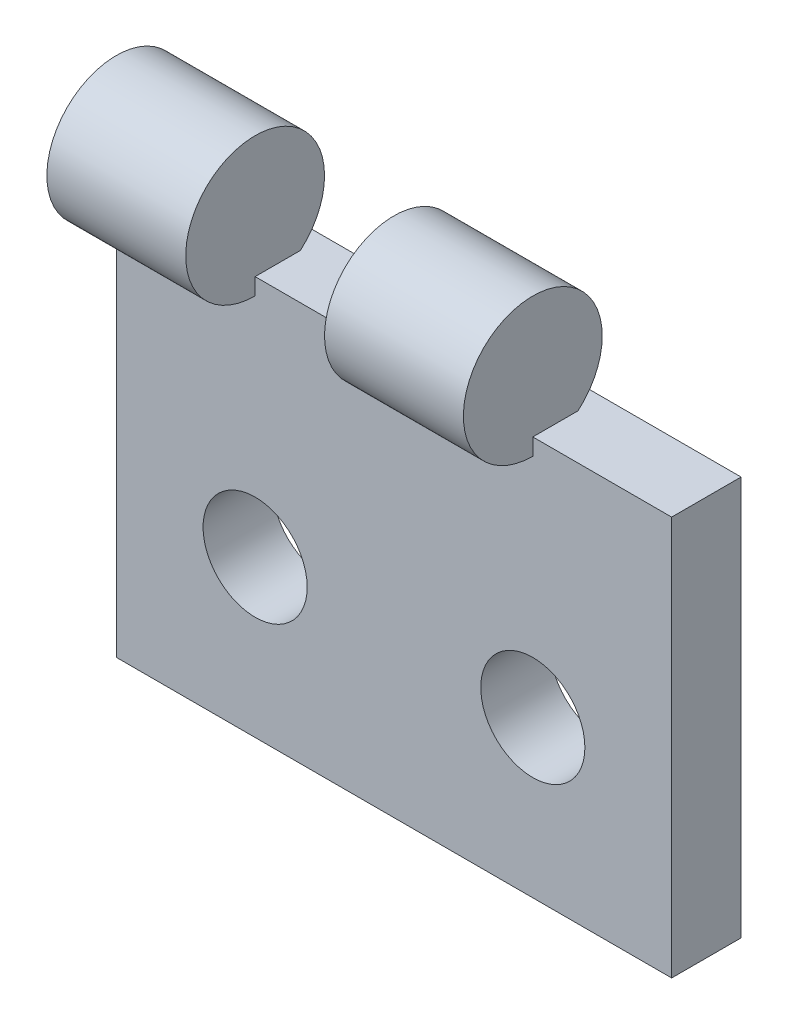
ISO-10303-21;
HEADER;
FILE_DESCRIPTION(('STEP AP214'),'2;1');
FILE_NAME('part.step','',(''),(''),'','','');
FILE_SCHEMA(('AUTOMOTIVE_DESIGN { 1 0 10303 214 1 1 1 1 }'));
ENDSEC;
DATA;
#1=APPLICATION_CONTEXT('core data for automotive mechanical design processes');
#2=APPLICATION_PROTOCOL_DEFINITION('international standard','automotive_design',2000,#1);
#3=PRODUCT_CONTEXT('',#1,'mechanical');
#4=PRODUCT('Part','Part','',(#3));
#5=PRODUCT_RELATED_PRODUCT_CATEGORY('part','',(#4));
#6=PRODUCT_DEFINITION_FORMATION('','',#4);
#7=PRODUCT_DEFINITION_CONTEXT('part definition',#1,'design');
#8=PRODUCT_DEFINITION('design','',#6,#7);
#9=PRODUCT_DEFINITION_SHAPE('','',#8);
#10=(LENGTH_UNIT() NAMED_UNIT(*) SI_UNIT(.MILLI.,.METRE.));
#11=(NAMED_UNIT(*) PLANE_ANGLE_UNIT() SI_UNIT($,.RADIAN.));
#12=(NAMED_UNIT(*) SI_UNIT($,.STERADIAN.) SOLID_ANGLE_UNIT());
#13=UNCERTAINTY_MEASURE_WITH_UNIT(LENGTH_MEASURE(1.E-05),#10,'distance_accuracy_value','');
#14=(GEOMETRIC_REPRESENTATION_CONTEXT(3) GLOBAL_UNCERTAINTY_ASSIGNED_CONTEXT((#13)) GLOBAL_UNIT_ASSIGNED_CONTEXT((#10,
#11,#12)) REPRESENTATION_CONTEXT('',''));
#15=CARTESIAN_POINT('',(0.,0.,0.));
#16=DIRECTION('',(0.,0.,1.));
#17=DIRECTION('',(1.,0.,0.));
#18=AXIS2_PLACEMENT_3D('',#15,#16,#17);
#19=CARTESIAN_POINT('',(0.,11.5,2.));
#20=DIRECTION('',(0.,-1.,0.));
#21=DIRECTION('',(0.,0.,-1.));
#22=AXIS2_PLACEMENT_3D('',#19,#20,#21);
#23=PLANE('',#22);
#24=DIRECTION('',(-1.,0.,0.));
#25=VECTOR('',#24,1.);
#26=CARTESIAN_POINT('',(12.,11.5,0.697745910079163));
#27=LINE('',#26,#25);
#28=CARTESIAN_POINT('',(12.,11.5,0.697745910079163));
#29=VERTEX_POINT('',#28);
#30=CARTESIAN_POINT('',(8.,11.5,0.697745910079163));
#31=VERTEX_POINT('',#30);
#32=EDGE_CURVE('E55',#29,#31,#27,.T.);
#33=ORIENTED_EDGE('',*,*,#32,.F.);
#34=DIRECTION('',(0.,0.,1.));
#35=VECTOR('',#34,1.);
#36=CARTESIAN_POINT('',(12.,11.5,2.));
#37=LINE('',#36,#35);
#38=CARTESIAN_POINT('',(12.,11.5,2.));
#39=VERTEX_POINT('',#38);
#40=EDGE_CURVE('E139',#29,#39,#37,.T.);
#41=ORIENTED_EDGE('',*,*,#40,.T.);
#42=DIRECTION('',(-1.,0.,0.));
#43=VECTOR('',#42,1.);
#44=CARTESIAN_POINT('',(0.,11.5,2.));
#45=LINE('',#44,#43);
#46=CARTESIAN_POINT('',(16.,11.5,2.));
#47=VERTEX_POINT('',#46);
#48=EDGE_CURVE('E172',#47,#39,#45,.T.);
#49=ORIENTED_EDGE('',*,*,#48,.F.);
#50=DIRECTION('',(0.,0.,-1.));
#51=VECTOR('',#50,1.);
#52=CARTESIAN_POINT('',(16.,11.5,2.));
#53=LINE('',#52,#51);
#54=CARTESIAN_POINT('',(16.,11.5,0.));
#55=VERTEX_POINT('',#54);
#56=EDGE_CURVE('E190',#47,#55,#53,.T.);
#57=ORIENTED_EDGE('',*,*,#56,.T.);
#58=DIRECTION('',(-1.,0.,0.));
#59=VECTOR('',#58,1.);
#60=CARTESIAN_POINT('',(0.,11.5,0.));
#61=LINE('',#60,#59);
#62=CARTESIAN_POINT('',(0.,11.5,0.));
#63=VERTEX_POINT('',#62);
#64=EDGE_CURVE('E165',#55,#63,#61,.T.);
#65=ORIENTED_EDGE('',*,*,#64,.T.);
#66=DIRECTION('',(0.,0.,-1.));
#67=VECTOR('',#66,1.);
#68=CARTESIAN_POINT('',(0.,11.5,2.));
#69=LINE('',#68,#67);
#70=CARTESIAN_POINT('',(0.,11.5,0.697745910079163));
#71=VERTEX_POINT('',#70);
#72=EDGE_CURVE('E175',#71,#63,#69,.T.);
#73=ORIENTED_EDGE('',*,*,#72,.F.);
#74=DIRECTION('',(-1.,0.,0.));
#75=VECTOR('',#74,1.);
#76=CARTESIAN_POINT('',(4.,11.5,0.697745910079163));
#77=LINE('',#76,#75);
#78=CARTESIAN_POINT('',(4.,11.5,0.697745910079163));
#79=VERTEX_POINT('',#78);
#80=EDGE_CURVE('E156',#79,#71,#77,.T.);
#81=ORIENTED_EDGE('',*,*,#80,.F.);
#82=DIRECTION('',(0.,0.,1.));
#83=VECTOR('',#82,1.);
#84=CARTESIAN_POINT('',(4.,11.5,2.));
#85=LINE('',#84,#83);
#86=CARTESIAN_POINT('',(4.,11.5,2.));
#87=VERTEX_POINT('',#86);
#88=EDGE_CURVE('E149',#79,#87,#85,.T.);
#89=ORIENTED_EDGE('',*,*,#88,.T.);
#90=CARTESIAN_POINT('',(8.,11.5,2.));
#91=VERTEX_POINT('',#90);
#92=EDGE_CURVE('E171',#91,#87,#45,.T.);
#93=ORIENTED_EDGE('',*,*,#92,.F.);
#94=DIRECTION('',(0.,0.,1.));
#95=VECTOR('',#94,1.);
#96=CARTESIAN_POINT('',(8.,11.5,2.));
#97=LINE('',#96,#95);
#98=EDGE_CURVE('E60',#31,#91,#97,.T.);
#99=ORIENTED_EDGE('',*,*,#98,.F.);
#100=EDGE_LOOP('',(#33,#41,#49,#57,#65,#73,#81,#89,#93,#99));
#101=FACE_BOUND('',#100,.T.);
#102=ADVANCED_FACE('F39',(#101),#23,.F.);
#103=CARTESIAN_POINT('',(0.,0.,2.));
#104=DIRECTION('',(0.,0.,-1.));
#105=DIRECTION('',(-1.,0.,0.));
#106=AXIS2_PLACEMENT_3D('',#103,#104,#105);
#107=PLANE('',#106);
#108=CARTESIAN_POINT('',(4.,4.5,2.));
#109=DIRECTION('',(0.,0.,1.));
#110=DIRECTION('',(1.,0.,0.));
#111=AXIS2_PLACEMENT_3D('',#108,#109,#110);
#112=CIRCLE('',#111,1.49999999999999);
#113=CARTESIAN_POINT('',(5.49999999999999,4.5,2.));
#114=VERTEX_POINT('',#113);
#115=EDGE_CURVE('E305',#114,#114,#112,.T.);
#116=ORIENTED_EDGE('',*,*,#115,.F.);
#117=EDGE_LOOP('',(#116));
#118=FACE_BOUND('',#117,.T.);
#119=CARTESIAN_POINT('',(12.,4.5,2.));
#120=DIRECTION('',(0.,0.,1.));
#121=DIRECTION('',(1.,0.,0.));
#122=AXIS2_PLACEMENT_3D('',#119,#120,#121);
#123=CIRCLE('',#122,1.49999999999999);
#124=CARTESIAN_POINT('',(13.5,4.5,2.));
#125=VERTEX_POINT('',#124);
#126=EDGE_CURVE('E134',#125,#125,#123,.T.);
#127=ORIENTED_EDGE('',*,*,#126,.F.);
#128=EDGE_LOOP('',(#127));
#129=FACE_BOUND('',#128,.T.);
#130=ORIENTED_EDGE('',*,*,#48,.T.);
#131=DIRECTION('',(0.,-1.,0.));
#132=VECTOR('',#131,1.);
#133=CARTESIAN_POINT('',(12.,0.,2.));
#134=LINE('',#133,#132);
#135=CARTESIAN_POINT('',(12.,11.0179375103358,2.));
#136=VERTEX_POINT('',#135);
#137=EDGE_CURVE('E11',#39,#136,#134,.T.);
#138=ORIENTED_EDGE('',*,*,#137,.T.);
#139=DIRECTION('',(-1.,0.,0.));
#140=VECTOR('',#139,1.);
#141=CARTESIAN_POINT('',(12.,11.0179375103358,2.));
#142=LINE('',#141,#140);
#143=CARTESIAN_POINT('',(8.,11.0179375103358,2.));
#144=VERTEX_POINT('',#143);
#145=EDGE_CURVE('E48',#144,#136,#142,.F.);
#146=ORIENTED_EDGE('',*,*,#145,.F.);
#147=DIRECTION('',(0.,-1.,0.));
#148=VECTOR('',#147,1.);
#149=CARTESIAN_POINT('',(8.,0.,2.));
#150=LINE('',#149,#148);
#151=EDGE_CURVE('E111',#91,#144,#150,.T.);
#152=ORIENTED_EDGE('',*,*,#151,.F.);
#153=ORIENTED_EDGE('',*,*,#92,.T.);
#154=DIRECTION('',(0.,-1.,0.));
#155=VECTOR('',#154,1.);
#156=CARTESIAN_POINT('',(4.,0.,2.));
#157=LINE('',#156,#155);
#158=CARTESIAN_POINT('',(4.,11.0179375103358,2.));
#159=VERTEX_POINT('',#158);
#160=EDGE_CURVE('E202',#87,#159,#157,.T.);
#161=ORIENTED_EDGE('',*,*,#160,.T.);
#162=DIRECTION('',(-1.,0.,0.));
#163=VECTOR('',#162,1.);
#164=CARTESIAN_POINT('',(4.,11.0179375103358,2.));
#165=LINE('',#164,#163);
#166=CARTESIAN_POINT('',(0.,11.0179375103358,2.));
#167=VERTEX_POINT('',#166);
#168=EDGE_CURVE('E123',#167,#159,#165,.F.);
#169=ORIENTED_EDGE('',*,*,#168,.F.);
#170=DIRECTION('',(0.,-1.,0.));
#171=VECTOR('',#170,1.);
#172=CARTESIAN_POINT('',(0.,0.,2.));
#173=LINE('',#172,#171);
#174=CARTESIAN_POINT('',(0.,0.,2.));
#175=VERTEX_POINT('',#174);
#176=EDGE_CURVE('E161',#167,#175,#173,.T.);
#177=ORIENTED_EDGE('',*,*,#176,.T.);
#178=DIRECTION('',(1.,0.,0.));
#179=VECTOR('',#178,1.);
#180=CARTESIAN_POINT('',(0.,0.,2.));
#181=LINE('',#180,#179);
#182=CARTESIAN_POINT('',(16.,0.,2.));
#183=VERTEX_POINT('',#182);
#184=EDGE_CURVE('E164',#175,#183,#181,.T.);
#185=ORIENTED_EDGE('',*,*,#184,.T.);
#186=DIRECTION('',(0.,1.,0.));
#187=VECTOR('',#186,1.);
#188=CARTESIAN_POINT('',(16.,0.,2.));
#189=LINE('',#188,#187);
#190=EDGE_CURVE('E168',#183,#47,#189,.T.);
#191=ORIENTED_EDGE('',*,*,#190,.T.);
#192=EDGE_LOOP('',(#130,#138,#146,#152,#153,#161,#169,#177,#185,#191));
#193=FACE_BOUND('',#192,.T.);
#194=ADVANCED_FACE('F110',(#118,#129,#193),#107,.F.);
#195=CARTESIAN_POINT('',(0.,0.,2.));
#196=DIRECTION('',(1.,0.,0.));
#197=DIRECTION('',(0.,0.,-1.));
#198=AXIS2_PLACEMENT_3D('',#195,#196,#197);
#199=PLANE('',#198);
#200=ORIENTED_EDGE('',*,*,#176,.F.);
#201=CARTESIAN_POINT('',(0.,13.0179375103358,2.));
#202=DIRECTION('',(1.,0.,0.));
#203=DIRECTION('',(0.,0.,-1.));
#204=AXIS2_PLACEMENT_3D('',#201,#202,#203);
#205=CIRCLE('',#204,2.);
#206=EDGE_CURVE('E144',#71,#167,#205,.T.);
#207=ORIENTED_EDGE('',*,*,#206,.F.);
#208=ORIENTED_EDGE('',*,*,#72,.T.);
#209=DIRECTION('',(0.,-1.,0.));
#210=VECTOR('',#209,1.);
#211=CARTESIAN_POINT('',(0.,0.,0.));
#212=LINE('',#211,#210);
#213=CARTESIAN_POINT('',(0.,0.,0.));
#214=VERTEX_POINT('',#213);
#215=EDGE_CURVE('E160',#63,#214,#212,.T.);
#216=ORIENTED_EDGE('',*,*,#215,.T.);
#217=DIRECTION('',(0.,0.,-1.));
#218=VECTOR('',#217,1.);
#219=CARTESIAN_POINT('',(0.,0.,2.));
#220=LINE('',#219,#218);
#221=EDGE_CURVE('E198',#175,#214,#220,.T.);
#222=ORIENTED_EDGE('',*,*,#221,.F.);
#223=EDGE_LOOP('',(#200,#207,#208,#216,#222));
#224=FACE_BOUND('',#223,.T.);
#225=ADVANCED_FACE('F41',(#224),#199,.F.);
#226=CARTESIAN_POINT('',(0.,0.,2.));
#227=DIRECTION('',(0.,1.,0.));
#228=DIRECTION('',(0.,0.,1.));
#229=AXIS2_PLACEMENT_3D('',#226,#227,#228);
#230=PLANE('',#229);
#231=DIRECTION('',(1.,0.,0.));
#232=VECTOR('',#231,1.);
#233=CARTESIAN_POINT('',(0.,0.,0.));
#234=LINE('',#233,#232);
#235=CARTESIAN_POINT('',(16.,0.,0.));
#236=VERTEX_POINT('',#235);
#237=EDGE_CURVE('E179',#214,#236,#234,.T.);
#238=ORIENTED_EDGE('',*,*,#237,.T.);
#239=DIRECTION('',(0.,0.,-1.));
#240=VECTOR('',#239,1.);
#241=CARTESIAN_POINT('',(16.,0.,2.));
#242=LINE('',#241,#240);
#243=EDGE_CURVE('E194',#183,#236,#242,.T.);
#244=ORIENTED_EDGE('',*,*,#243,.F.);
#245=ORIENTED_EDGE('',*,*,#184,.F.);
#246=ORIENTED_EDGE('',*,*,#221,.T.);
#247=EDGE_LOOP('',(#238,#244,#245,#246));
#248=FACE_BOUND('',#247,.T.);
#249=ADVANCED_FACE('F221',(#248),#230,.F.);
#250=CARTESIAN_POINT('',(16.,0.,2.));
#251=DIRECTION('',(-1.,0.,0.));
#252=DIRECTION('',(0.,0.,1.));
#253=AXIS2_PLACEMENT_3D('',#250,#251,#252);
#254=PLANE('',#253);
#255=DIRECTION('',(0.,1.,0.));
#256=VECTOR('',#255,1.);
#257=CARTESIAN_POINT('',(16.,0.,0.));
#258=LINE('',#257,#256);
#259=EDGE_CURVE('E182',#236,#55,#258,.T.);
#260=ORIENTED_EDGE('',*,*,#259,.T.);
#261=ORIENTED_EDGE('',*,*,#56,.F.);
#262=ORIENTED_EDGE('',*,*,#190,.F.);
#263=ORIENTED_EDGE('',*,*,#243,.T.);
#264=EDGE_LOOP('',(#260,#261,#262,#263));
#265=FACE_BOUND('',#264,.T.);
#266=ADVANCED_FACE('F226',(#265),#254,.F.);
#267=CARTESIAN_POINT('',(0.,0.,0.));
#268=DIRECTION('',(0.,0.,-1.));
#269=DIRECTION('',(-1.,0.,0.));
#270=AXIS2_PLACEMENT_3D('',#267,#268,#269);
#271=PLANE('',#270);
#272=CARTESIAN_POINT('',(4.,4.5,0.));
#273=DIRECTION('',(0.,0.,1.));
#274=DIRECTION('',(1.,0.,0.));
#275=AXIS2_PLACEMENT_3D('',#272,#273,#274);
#276=CIRCLE('',#275,1.5);
#277=CARTESIAN_POINT('',(5.5,4.5,0.));
#278=VERTEX_POINT('',#277);
#279=EDGE_CURVE('E302',#278,#278,#276,.T.);
#280=ORIENTED_EDGE('',*,*,#279,.T.);
#281=EDGE_LOOP('',(#280));
#282=FACE_BOUND('',#281,.T.);
#283=CARTESIAN_POINT('',(12.,4.5,0.));
#284=DIRECTION('',(0.,0.,1.));
#285=DIRECTION('',(1.,0.,0.));
#286=AXIS2_PLACEMENT_3D('',#283,#284,#285);
#287=CIRCLE('',#286,1.5);
#288=CARTESIAN_POINT('',(13.5,4.5,0.));
#289=VERTEX_POINT('',#288);
#290=EDGE_CURVE('E128',#289,#289,#287,.T.);
#291=ORIENTED_EDGE('',*,*,#290,.T.);
#292=EDGE_LOOP('',(#291));
#293=FACE_BOUND('',#292,.T.);
#294=ORIENTED_EDGE('',*,*,#215,.F.);
#295=ORIENTED_EDGE('',*,*,#64,.F.);
#296=ORIENTED_EDGE('',*,*,#259,.F.);
#297=ORIENTED_EDGE('',*,*,#237,.F.);
#298=EDGE_LOOP('',(#294,#295,#296,#297));
#299=FACE_BOUND('',#298,.T.);
#300=ADVANCED_FACE('F249',(#282,#293,#299),#271,.T.);
#301=CARTESIAN_POINT('',(4.,13.0179375103358,2.));
#302=DIRECTION('',(-1.,0.,0.));
#303=DIRECTION('',(0.,0.,1.));
#304=AXIS2_PLACEMENT_3D('',#301,#302,#303);
#305=CYLINDRICAL_SURFACE('',#304,2.);
#306=CARTESIAN_POINT('',(4.,13.0179375103358,2.));
#307=DIRECTION('',(1.,0.,0.));
#308=DIRECTION('',(0.,0.,-1.));
#309=AXIS2_PLACEMENT_3D('',#306,#307,#308);
#310=CIRCLE('',#309,2.);
#311=EDGE_CURVE('E145',#79,#159,#310,.T.);
#312=ORIENTED_EDGE('',*,*,#311,.F.);
#313=ORIENTED_EDGE('',*,*,#80,.T.);
#314=ORIENTED_EDGE('',*,*,#206,.T.);
#315=ORIENTED_EDGE('',*,*,#168,.T.);
#316=EDGE_LOOP('',(#312,#313,#314,#315));
#317=FACE_BOUND('',#316,.T.);
#318=ADVANCED_FACE('F210',(#317),#305,.T.);
#319=CARTESIAN_POINT('',(4.,13.0179375103358,2.));
#320=DIRECTION('',(1.,0.,0.));
#321=DIRECTION('',(0.,0.,-1.));
#322=AXIS2_PLACEMENT_3D('',#319,#320,#321);
#323=PLANE('',#322);
#324=ORIENTED_EDGE('',*,*,#88,.F.);
#325=ORIENTED_EDGE('',*,*,#311,.T.);
#326=ORIENTED_EDGE('',*,*,#160,.F.);
#327=EDGE_LOOP('',(#324,#325,#326));
#328=FACE_BOUND('',#327,.T.);
#329=ADVANCED_FACE('F215',(#328),#323,.T.);
#330=CARTESIAN_POINT('',(12.,13.0179375103358,2.));
#331=DIRECTION('',(-1.,0.,0.));
#332=DIRECTION('',(0.,0.,1.));
#333=AXIS2_PLACEMENT_3D('',#330,#331,#332);
#334=CYLINDRICAL_SURFACE('',#333,2.);
#335=CARTESIAN_POINT('',(12.,13.0179375103358,2.));
#336=DIRECTION('',(1.,0.,0.));
#337=DIRECTION('',(0.,0.,-1.));
#338=AXIS2_PLACEMENT_3D('',#335,#336,#337);
#339=CIRCLE('',#338,2.);
#340=EDGE_CURVE('E127',#29,#136,#339,.T.);
#341=ORIENTED_EDGE('',*,*,#340,.F.);
#342=ORIENTED_EDGE('',*,*,#32,.T.);
#343=CARTESIAN_POINT('',(8.,13.0179375103358,2.));
#344=DIRECTION('',(1.,0.,0.));
#345=DIRECTION('',(0.,0.,-1.));
#346=AXIS2_PLACEMENT_3D('',#343,#344,#345);
#347=CIRCLE('',#346,2.);
#348=EDGE_CURVE('E121',#31,#144,#347,.T.);
#349=ORIENTED_EDGE('',*,*,#348,.T.);
#350=ORIENTED_EDGE('',*,*,#145,.T.);
#351=EDGE_LOOP('',(#341,#342,#349,#350));
#352=FACE_BOUND('',#351,.T.);
#353=ADVANCED_FACE('F125',(#352),#334,.T.);
#354=CARTESIAN_POINT('',(12.,13.0179375103358,2.));
#355=DIRECTION('',(1.,0.,0.));
#356=DIRECTION('',(0.,0.,-1.));
#357=AXIS2_PLACEMENT_3D('',#354,#355,#356);
#358=PLANE('',#357);
#359=ORIENTED_EDGE('',*,*,#40,.F.);
#360=ORIENTED_EDGE('',*,*,#340,.T.);
#361=ORIENTED_EDGE('',*,*,#137,.F.);
#362=EDGE_LOOP('',(#359,#360,#361));
#363=FACE_BOUND('',#362,.T.);
#364=ADVANCED_FACE('F229',(#363),#358,.T.);
#365=CARTESIAN_POINT('',(8.,13.0179375103358,2.));
#366=DIRECTION('',(1.,0.,0.));
#367=DIRECTION('',(0.,0.,-1.));
#368=AXIS2_PLACEMENT_3D('',#365,#366,#367);
#369=PLANE('',#368);
#370=ORIENTED_EDGE('',*,*,#348,.F.);
#371=ORIENTED_EDGE('',*,*,#98,.T.);
#372=ORIENTED_EDGE('',*,*,#151,.T.);
#373=EDGE_LOOP('',(#370,#371,#372));
#374=FACE_BOUND('',#373,.T.);
#375=ADVANCED_FACE('F120',(#374),#369,.F.);
#376=CARTESIAN_POINT('',(12.,4.5,2.));
#377=DIRECTION('',(0.,0.,1.));
#378=DIRECTION('',(1.,0.,0.));
#379=AXIS2_PLACEMENT_3D('',#376,#377,#378);
#380=CYLINDRICAL_SURFACE('',#379,1.49999999999999);
#381=ORIENTED_EDGE('',*,*,#290,.F.);
#382=EDGE_LOOP('',(#381));
#383=FACE_BOUND('',#382,.T.);
#384=ORIENTED_EDGE('',*,*,#126,.T.);
#385=EDGE_LOOP('',(#384));
#386=FACE_BOUND('',#385,.T.);
#387=ADVANCED_FACE('F236',(#383,#386),#380,.F.);
#388=CARTESIAN_POINT('',(4.,4.5,2.));
#389=DIRECTION('',(0.,0.,1.));
#390=DIRECTION('',(1.,0.,0.));
#391=AXIS2_PLACEMENT_3D('',#388,#389,#390);
#392=CYLINDRICAL_SURFACE('',#391,1.49999999999999);
#393=ORIENTED_EDGE('',*,*,#279,.F.);
#394=EDGE_LOOP('',(#393));
#395=FACE_BOUND('',#394,.T.);
#396=ORIENTED_EDGE('',*,*,#115,.T.);
#397=EDGE_LOOP('',(#396));
#398=FACE_BOUND('',#397,.T.);
#399=ADVANCED_FACE('F286',(#395,#398),#392,.F.);
#400=CLOSED_SHELL('',(#102,#194,#225,#249,#266,#300,#318,#329,#353,#364,#375,#387,#399));
#401=MANIFOLD_SOLID_BREP('B2',#400);
#402=ADVANCED_BREP_SHAPE_REPRESENTATION('',(#18,#401),#14);
#403=SHAPE_DEFINITION_REPRESENTATION(#9,#402);
ENDSEC;
END-ISO-10303-21;
